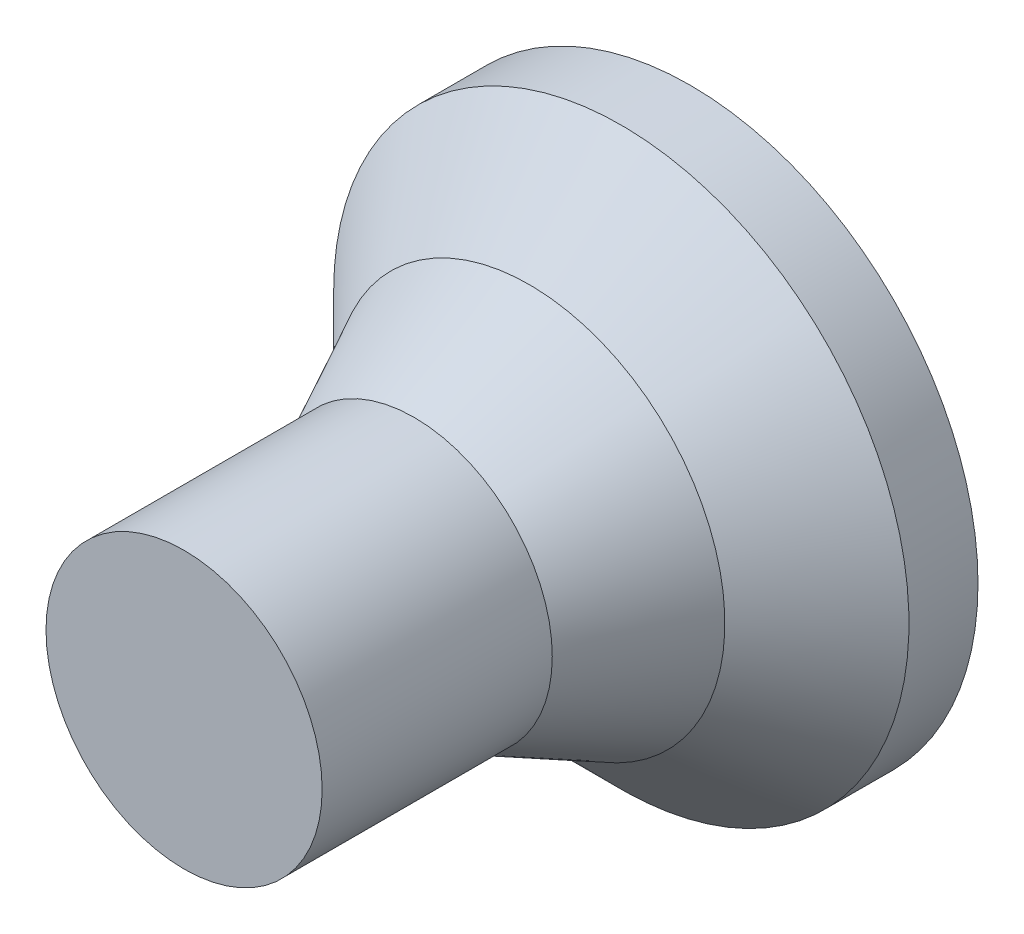
ISO-10303-21;
HEADER;
FILE_DESCRIPTION(('STEP AP214'),'2;1');
FILE_NAME('part.step','',(''),(''),'','','');
FILE_SCHEMA(('AUTOMOTIVE_DESIGN { 1 0 10303 214 1 1 1 1 }'));
ENDSEC;
DATA;
#1=APPLICATION_CONTEXT('core data for automotive mechanical design processes');
#2=APPLICATION_PROTOCOL_DEFINITION('international standard','automotive_design',2000,#1);
#3=PRODUCT_CONTEXT('',#1,'mechanical');
#4=PRODUCT('Part','Part','',(#3));
#5=PRODUCT_RELATED_PRODUCT_CATEGORY('part','',(#4));
#6=PRODUCT_DEFINITION_FORMATION('','',#4);
#7=PRODUCT_DEFINITION_CONTEXT('part definition',#1,'design');
#8=PRODUCT_DEFINITION('design','',#6,#7);
#9=PRODUCT_DEFINITION_SHAPE('','',#8);
#10=(LENGTH_UNIT() NAMED_UNIT(*) SI_UNIT(.MILLI.,.METRE.));
#11=(NAMED_UNIT(*) PLANE_ANGLE_UNIT() SI_UNIT($,.RADIAN.));
#12=(NAMED_UNIT(*) SI_UNIT($,.STERADIAN.) SOLID_ANGLE_UNIT());
#13=UNCERTAINTY_MEASURE_WITH_UNIT(LENGTH_MEASURE(1.E-05),#10,'distance_accuracy_value','');
#14=(GEOMETRIC_REPRESENTATION_CONTEXT(3) GLOBAL_UNCERTAINTY_ASSIGNED_CONTEXT((#13)) GLOBAL_UNIT_ASSIGNED_CONTEXT((#10,
#11,#12)) REPRESENTATION_CONTEXT('',''));
#15=CARTESIAN_POINT('',(0.,0.,0.));
#16=DIRECTION('',(0.,0.,1.));
#17=DIRECTION('',(1.,0.,0.));
#18=AXIS2_PLACEMENT_3D('',#15,#16,#17);
#19=CARTESIAN_POINT('',(0.,0.,220.));
#20=DIRECTION('',(0.,0.,-1.));
#21=DIRECTION('',(-1.,0.,0.));
#22=AXIS2_PLACEMENT_3D('',#19,#20,#21);
#23=CYLINDRICAL_SURFACE('',#22,60.);
#24=CARTESIAN_POINT('',(0.,0.,220.));
#25=DIRECTION('',(0.,0.,-1.));
#26=DIRECTION('',(-1.,0.,0.));
#27=AXIS2_PLACEMENT_3D('',#24,#25,#26);
#28=CIRCLE('',#27,60.);
#29=CARTESIAN_POINT('',(-60.,0.,220.));
#30=VERTEX_POINT('',#29);
#31=EDGE_CURVE('E11',#30,#30,#28,.T.);
#32=ORIENTED_EDGE('',*,*,#31,.T.);
#33=EDGE_LOOP('',(#32));
#34=FACE_BOUND('',#33,.T.);
#35=CARTESIAN_POINT('',(0.,0.,120.));
#36=DIRECTION('',(0.,0.,-1.));
#37=DIRECTION('',(-1.,0.,0.));
#38=AXIS2_PLACEMENT_3D('',#35,#36,#37);
#39=CIRCLE('',#38,60.);
#40=CARTESIAN_POINT('',(-60.,0.,120.));
#41=VERTEX_POINT('',#40);
#42=EDGE_CURVE('E52',#41,#41,#39,.T.);
#43=ORIENTED_EDGE('',*,*,#42,.F.);
#44=EDGE_LOOP('',(#43));
#45=FACE_BOUND('',#44,.T.);
#46=ADVANCED_FACE('F45',(#34,#45),#23,.T.);
#47=CARTESIAN_POINT('',(0.,0.,220.));
#48=DIRECTION('',(0.,0.,-1.));
#49=DIRECTION('',(-1.,0.,0.));
#50=AXIS2_PLACEMENT_3D('',#47,#48,#49);
#51=PLANE('',#50);
#52=ORIENTED_EDGE('',*,*,#31,.F.);
#53=EDGE_LOOP('',(#52));
#54=FACE_BOUND('',#53,.T.);
#55=ADVANCED_FACE('F75',(#54),#51,.F.);
#56=CARTESIAN_POINT('',(0.,0.,120.));
#57=DIRECTION('',(0.,0.,-1.));
#58=DIRECTION('',(-1.,0.,0.));
#59=AXIS2_PLACEMENT_3D('',#56,#57,#58);
#60=CONICAL_SURFACE('',#59,60.,0.463647609000806);
#61=CARTESIAN_POINT('',(0.,0.,70.));
#62=DIRECTION('',(0.,0.,-1.));
#63=DIRECTION('',(-1.,0.,0.));
#64=AXIS2_PLACEMENT_3D('',#61,#62,#63);
#65=CIRCLE('',#64,85.);
#66=CARTESIAN_POINT('',(-85.,0.,70.));
#67=VERTEX_POINT('',#66);
#68=EDGE_CURVE('E57',#67,#67,#65,.T.);
#69=ORIENTED_EDGE('',*,*,#68,.F.);
#70=EDGE_LOOP('',(#69));
#71=FACE_BOUND('',#70,.T.);
#72=ORIENTED_EDGE('',*,*,#42,.T.);
#73=EDGE_LOOP('',(#72));
#74=FACE_BOUND('',#73,.T.);
#75=ADVANCED_FACE('F65',(#71,#74),#60,.T.);
#76=CARTESIAN_POINT('',(0.,0.,30.));
#77=DIRECTION('',(0.,0.,-1.));
#78=DIRECTION('',(-1.,0.,0.));
#79=AXIS2_PLACEMENT_3D('',#76,#77,#78);
#80=CYLINDRICAL_SURFACE('',#79,125.);
#81=CARTESIAN_POINT('',(0.,0.,30.));
#82=DIRECTION('',(0.,0.,-1.));
#83=DIRECTION('',(-1.,0.,0.));
#84=AXIS2_PLACEMENT_3D('',#81,#82,#83);
#85=CIRCLE('',#84,125.);
#86=CARTESIAN_POINT('',(-125.,0.,30.));
#87=VERTEX_POINT('',#86);
#88=EDGE_CURVE('E148',#87,#87,#85,.F.);
#89=ORIENTED_EDGE('',*,*,#88,.F.);
#90=EDGE_LOOP('',(#89));
#91=FACE_BOUND('',#90,.T.);
#92=CARTESIAN_POINT('',(0.,0.,0.));
#93=DIRECTION('',(0.,0.,1.));
#94=DIRECTION('',(1.,0.,0.));
#95=AXIS2_PLACEMENT_3D('',#92,#93,#94);
#96=CIRCLE('',#95,125.);
#97=CARTESIAN_POINT('',(125.,0.,0.));
#98=VERTEX_POINT('',#97);
#99=EDGE_CURVE('E140',#98,#98,#96,.T.);
#100=ORIENTED_EDGE('',*,*,#99,.T.);
#101=EDGE_LOOP('',(#100));
#102=FACE_BOUND('',#101,.T.);
#103=ADVANCED_FACE('F74',(#91,#102),#80,.T.);
#104=CARTESIAN_POINT('',(0.,0.,0.));
#105=DIRECTION('',(0.,0.,1.));
#106=DIRECTION('',(1.,0.,0.));
#107=AXIS2_PLACEMENT_3D('',#104,#105,#106);
#108=PLANE('',#107);
#109=ORIENTED_EDGE('',*,*,#99,.F.);
#110=EDGE_LOOP('',(#109));
#111=FACE_BOUND('',#110,.T.);
#112=ADVANCED_FACE('F101',(#111),#108,.F.);
#113=CARTESIAN_POINT('',(0.,0.,70.));
#114=DIRECTION('',(0.,0.,-1.));
#115=DIRECTION('',(-1.,0.,0.));
#116=AXIS2_PLACEMENT_3D('',#113,#114,#115);
#117=CONICAL_SURFACE('',#116,85.,0.785398163397448);
#118=ORIENTED_EDGE('',*,*,#68,.T.);
#119=EDGE_LOOP('',(#118));
#120=FACE_BOUND('',#119,.T.);
#121=ORIENTED_EDGE('',*,*,#88,.T.);
#122=EDGE_LOOP('',(#121));
#123=FACE_BOUND('',#122,.T.);
#124=ADVANCED_FACE('F109',(#120,#123),#117,.T.);
#125=CLOSED_SHELL('',(#46,#55,#75,#103,#112,#124));
#126=MANIFOLD_SOLID_BREP('B2',#125);
#127=ADVANCED_BREP_SHAPE_REPRESENTATION('',(#18,#126),#14);
#128=SHAPE_DEFINITION_REPRESENTATION(#9,#127);
ENDSEC;
END-ISO-10303-21;
